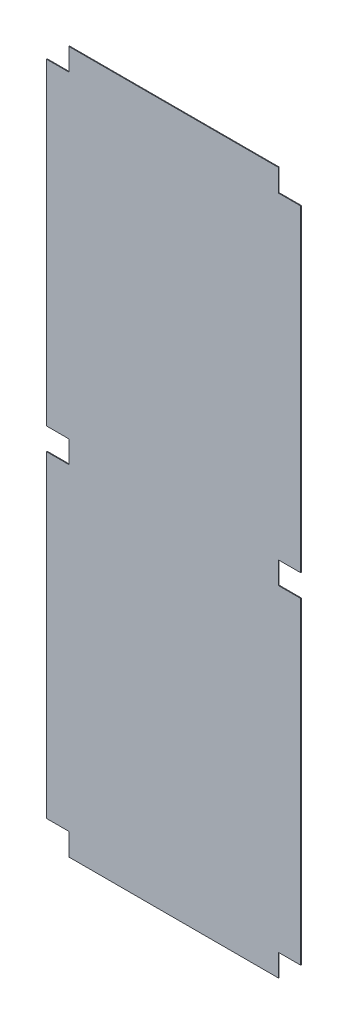
ISO-10303-21;
HEADER;
FILE_DESCRIPTION(('STEP AP214'),'2;1');
FILE_NAME('part.step','',(''),(''),'','','');
FILE_SCHEMA(('AUTOMOTIVE_DESIGN { 1 0 10303 214 1 1 1 1 }'));
ENDSEC;
DATA;
#1=APPLICATION_CONTEXT('core data for automotive mechanical design processes');
#2=APPLICATION_PROTOCOL_DEFINITION('international standard','automotive_design',2000,#1);
#3=PRODUCT_CONTEXT('',#1,'mechanical');
#4=PRODUCT('Part','Part','',(#3));
#5=PRODUCT_RELATED_PRODUCT_CATEGORY('part','',(#4));
#6=PRODUCT_DEFINITION_FORMATION('','',#4);
#7=PRODUCT_DEFINITION_CONTEXT('part definition',#1,'design');
#8=PRODUCT_DEFINITION('design','',#6,#7);
#9=PRODUCT_DEFINITION_SHAPE('','',#8);
#10=(LENGTH_UNIT() NAMED_UNIT(*) SI_UNIT(.MILLI.,.METRE.));
#11=(NAMED_UNIT(*) PLANE_ANGLE_UNIT() SI_UNIT($,.RADIAN.));
#12=(NAMED_UNIT(*) SI_UNIT($,.STERADIAN.) SOLID_ANGLE_UNIT());
#13=UNCERTAINTY_MEASURE_WITH_UNIT(LENGTH_MEASURE(1.E-05),#10,'distance_accuracy_value','');
#14=(GEOMETRIC_REPRESENTATION_CONTEXT(3) GLOBAL_UNCERTAINTY_ASSIGNED_CONTEXT((#13)) GLOBAL_UNIT_ASSIGNED_CONTEXT((#10,
#11,#12)) REPRESENTATION_CONTEXT('',''));
#15=CARTESIAN_POINT('',(0.,0.,0.));
#16=DIRECTION('',(0.,0.,1.));
#17=DIRECTION('',(1.,0.,0.));
#18=AXIS2_PLACEMENT_3D('',#15,#16,#17);
#19=CARTESIAN_POINT('',(0.,0.,-0.7));
#20=DIRECTION('',(-1.,0.,0.));
#21=DIRECTION('',(0.,0.,1.));
#22=AXIS2_PLACEMENT_3D('',#19,#20,#21);
#23=PLANE('',#22);
#24=DIRECTION('',(0.,0.,-1.));
#25=VECTOR('',#24,1.);
#26=CARTESIAN_POINT('',(0.,321.2,9.3));
#27=LINE('',#26,#25);
#28=CARTESIAN_POINT('',(0.,321.2,0.));
#29=VERTEX_POINT('',#28);
#30=CARTESIAN_POINT('',(0.,321.2,-0.7));
#31=VERTEX_POINT('',#30);
#32=EDGE_CURVE('E246',#29,#31,#27,.T.);
#33=ORIENTED_EDGE('',*,*,#32,.T.);
#34=DIRECTION('',(0.,-1.,0.));
#35=VECTOR('',#34,1.);
#36=CARTESIAN_POINT('',(0.,0.,-0.7));
#37=LINE('',#36,#35);
#38=CARTESIAN_POINT('',(0.,20.9999999999998,-0.699999999999999));
#39=VERTEX_POINT('',#38);
#40=EDGE_CURVE('E200',#31,#39,#37,.T.);
#41=ORIENTED_EDGE('',*,*,#40,.T.);
#42=DIRECTION('',(0.,0.,1.));
#43=VECTOR('',#42,1.);
#44=CARTESIAN_POINT('',(0.,20.9999999999998,-10.));
#45=LINE('',#44,#43);
#46=CARTESIAN_POINT('',(0.,20.9999999999998,0.));
#47=VERTEX_POINT('',#46);
#48=EDGE_CURVE('E272',#39,#47,#45,.T.);
#49=ORIENTED_EDGE('',*,*,#48,.T.);
#50=DIRECTION('',(0.,-1.,0.));
#51=VECTOR('',#50,1.);
#52=CARTESIAN_POINT('',(0.,0.,0.));
#53=LINE('',#52,#51);
#54=EDGE_CURVE('E220',#29,#47,#53,.T.);
#55=ORIENTED_EDGE('',*,*,#54,.F.);
#56=EDGE_LOOP('',(#33,#41,#49,#55));
#57=FACE_BOUND('',#56,.T.);
#58=ADVANCED_FACE('F39',(#57),#23,.T.);
#59=CARTESIAN_POINT('',(240.,0.,-0.7));
#60=DIRECTION('',(1.,0.,0.));
#61=DIRECTION('',(0.,0.,-1.));
#62=AXIS2_PLACEMENT_3D('',#59,#60,#61);
#63=PLANE('',#62);
#64=DIRECTION('',(0.,0.,-1.));
#65=VECTOR('',#64,1.);
#66=CARTESIAN_POINT('',(240.,321.2,9.3));
#67=LINE('',#66,#65);
#68=CARTESIAN_POINT('',(240.,321.2,0.));
#69=VERTEX_POINT('',#68);
#70=CARTESIAN_POINT('',(240.,321.2,-0.7));
#71=VERTEX_POINT('',#70);
#72=EDGE_CURVE('E195',#69,#71,#67,.T.);
#73=ORIENTED_EDGE('',*,*,#72,.F.);
#74=DIRECTION('',(0.,1.,0.));
#75=VECTOR('',#74,1.);
#76=CARTESIAN_POINT('',(240.,0.,0.));
#77=LINE('',#76,#75);
#78=CARTESIAN_POINT('',(240.,20.9999999999998,0.));
#79=VERTEX_POINT('',#78);
#80=EDGE_CURVE('E224',#79,#69,#77,.T.);
#81=ORIENTED_EDGE('',*,*,#80,.F.);
#82=DIRECTION('',(0.,0.,1.));
#83=VECTOR('',#82,1.);
#84=CARTESIAN_POINT('',(240.,20.9999999999998,-10.));
#85=LINE('',#84,#83);
#86=CARTESIAN_POINT('',(240.,20.9999999999998,-0.699999999999999));
#87=VERTEX_POINT('',#86);
#88=EDGE_CURVE('E298',#87,#79,#85,.T.);
#89=ORIENTED_EDGE('',*,*,#88,.F.);
#90=DIRECTION('',(0.,1.,0.));
#91=VECTOR('',#90,1.);
#92=CARTESIAN_POINT('',(240.,0.,-0.7));
#93=LINE('',#92,#91);
#94=EDGE_CURVE('E210',#87,#71,#93,.T.);
#95=ORIENTED_EDGE('',*,*,#94,.T.);
#96=EDGE_LOOP('',(#73,#81,#89,#95));
#97=FACE_BOUND('',#96,.T.);
#98=ADVANCED_FACE('F358',(#97),#63,.T.);
#99=DIRECTION('',(0.,0.,-1.));
#100=VECTOR('',#99,1.);
#101=CARTESIAN_POINT('',(0.,342.2,9.3));
#102=LINE('',#101,#100);
#103=CARTESIAN_POINT('',(0.,342.2,0.));
#104=VERTEX_POINT('',#103);
#105=CARTESIAN_POINT('',(0.,342.2,-0.7));
#106=VERTEX_POINT('',#105);
#107=EDGE_CURVE('E174',#104,#106,#102,.T.);
#108=ORIENTED_EDGE('',*,*,#107,.F.);
#109=CARTESIAN_POINT('',(0.,642.4,0.));
#110=VERTEX_POINT('',#109);
#111=EDGE_CURVE('E217',#110,#104,#53,.T.);
#112=ORIENTED_EDGE('',*,*,#111,.F.);
#113=DIRECTION('',(0.,0.,1.));
#114=VECTOR('',#113,1.);
#115=CARTESIAN_POINT('',(2.22044604925031E-13,642.4,-10.));
#116=LINE('',#115,#114);
#117=CARTESIAN_POINT('',(2.22044604925031E-13,642.4,-0.699999999999999));
#118=VERTEX_POINT('',#117);
#119=EDGE_CURVE('E198',#118,#110,#116,.T.);
#120=ORIENTED_EDGE('',*,*,#119,.F.);
#121=EDGE_CURVE('E192',#118,#106,#37,.T.);
#122=ORIENTED_EDGE('',*,*,#121,.T.);
#123=EDGE_LOOP('',(#108,#112,#120,#122));
#124=FACE_BOUND('',#123,.T.);
#125=ADVANCED_FACE('F41',(#124),#23,.T.);
#126=CARTESIAN_POINT('',(0.,663.4,-0.7));
#127=DIRECTION('',(0.,1.,0.));
#128=DIRECTION('',(0.,0.,1.));
#129=AXIS2_PLACEMENT_3D('',#126,#127,#128);
#130=PLANE('',#129);
#131=DIRECTION('',(0.,0.,1.));
#132=VECTOR('',#131,1.);
#133=CARTESIAN_POINT('',(21.,663.4,-10.));
#134=LINE('',#133,#132);
#135=CARTESIAN_POINT('',(21.,663.4,-0.699999999999999));
#136=VERTEX_POINT('',#135);
#137=CARTESIAN_POINT('',(21.,663.4,0.));
#138=VERTEX_POINT('',#137);
#139=EDGE_CURVE('E274',#136,#138,#134,.T.);
#140=ORIENTED_EDGE('',*,*,#139,.T.);
#141=DIRECTION('',(-1.,0.,0.));
#142=VECTOR('',#141,1.);
#143=CARTESIAN_POINT('',(0.,663.4,0.));
#144=LINE('',#143,#142);
#145=CARTESIAN_POINT('',(219.,663.4,0.));
#146=VERTEX_POINT('',#145);
#147=EDGE_CURVE('E205',#146,#138,#144,.T.);
#148=ORIENTED_EDGE('',*,*,#147,.F.);
#149=DIRECTION('',(0.,0.,1.));
#150=VECTOR('',#149,1.);
#151=CARTESIAN_POINT('',(219.,663.4,-10.));
#152=LINE('',#151,#150);
#153=CARTESIAN_POINT('',(219.,663.4,-0.699999999999999));
#154=VERTEX_POINT('',#153);
#155=EDGE_CURVE('E309',#154,#146,#152,.T.);
#156=ORIENTED_EDGE('',*,*,#155,.F.);
#157=DIRECTION('',(-1.,0.,0.));
#158=VECTOR('',#157,1.);
#159=CARTESIAN_POINT('',(0.,663.4,-0.7));
#160=LINE('',#159,#158);
#161=EDGE_CURVE('E213',#154,#136,#160,.T.);
#162=ORIENTED_EDGE('',*,*,#161,.T.);
#163=EDGE_LOOP('',(#140,#148,#156,#162));
#164=FACE_BOUND('',#163,.T.);
#165=ADVANCED_FACE('F387',(#164),#130,.T.);
#166=DIRECTION('',(0.,0.,-1.));
#167=VECTOR('',#166,1.);
#168=CARTESIAN_POINT('',(240.,342.2,9.3));
#169=LINE('',#168,#167);
#170=CARTESIAN_POINT('',(240.,342.2,0.));
#171=VERTEX_POINT('',#170);
#172=CARTESIAN_POINT('',(240.,342.2,-0.7));
#173=VERTEX_POINT('',#172);
#174=EDGE_CURVE('E263',#171,#173,#169,.T.);
#175=ORIENTED_EDGE('',*,*,#174,.T.);
#176=CARTESIAN_POINT('',(240.,642.4,-0.699999999999999));
#177=VERTEX_POINT('',#176);
#178=EDGE_CURVE('E203',#173,#177,#93,.T.);
#179=ORIENTED_EDGE('',*,*,#178,.T.);
#180=DIRECTION('',(0.,0.,1.));
#181=VECTOR('',#180,1.);
#182=CARTESIAN_POINT('',(240.,642.4,-10.));
#183=LINE('',#182,#181);
#184=CARTESIAN_POINT('',(240.,642.4,0.));
#185=VERTEX_POINT('',#184);
#186=EDGE_CURVE('E310',#177,#185,#183,.T.);
#187=ORIENTED_EDGE('',*,*,#186,.T.);
#188=EDGE_CURVE('E223',#171,#185,#77,.T.);
#189=ORIENTED_EDGE('',*,*,#188,.F.);
#190=EDGE_LOOP('',(#175,#179,#187,#189));
#191=FACE_BOUND('',#190,.T.);
#192=ADVANCED_FACE('F373',(#191),#63,.T.);
#193=CARTESIAN_POINT('',(0.,0.,-0.7));
#194=DIRECTION('',(0.,-1.,0.));
#195=DIRECTION('',(0.,0.,-1.));
#196=AXIS2_PLACEMENT_3D('',#193,#194,#195);
#197=PLANE('',#196);
#198=DIRECTION('',(0.,0.,1.));
#199=VECTOR('',#198,1.);
#200=CARTESIAN_POINT('',(219.,-2.22044604925031E-13,-10.));
#201=LINE('',#200,#199);
#202=CARTESIAN_POINT('',(219.,-2.22044604925031E-13,-0.699999999999999));
#203=VERTEX_POINT('',#202);
#204=CARTESIAN_POINT('',(219.,-2.22044604925031E-13,0.));
#205=VERTEX_POINT('',#204);
#206=EDGE_CURVE('E285',#203,#205,#201,.T.);
#207=ORIENTED_EDGE('',*,*,#206,.T.);
#208=DIRECTION('',(1.,0.,0.));
#209=VECTOR('',#208,1.);
#210=CARTESIAN_POINT('',(0.,0.,0.));
#211=LINE('',#210,#209);
#212=CARTESIAN_POINT('',(21.,0.,0.));
#213=VERTEX_POINT('',#212);
#214=EDGE_CURVE('E219',#213,#205,#211,.T.);
#215=ORIENTED_EDGE('',*,*,#214,.F.);
#216=DIRECTION('',(0.,0.,1.));
#217=VECTOR('',#216,1.);
#218=CARTESIAN_POINT('',(21.,-2.22044604925031E-13,-10.));
#219=LINE('',#218,#217);
#220=CARTESIAN_POINT('',(21.,-2.22044604925031E-13,-0.699999999999999));
#221=VERTEX_POINT('',#220);
#222=EDGE_CURVE('E288',#221,#213,#219,.T.);
#223=ORIENTED_EDGE('',*,*,#222,.F.);
#224=DIRECTION('',(1.,0.,0.));
#225=VECTOR('',#224,1.);
#226=CARTESIAN_POINT('',(0.,0.,-0.7));
#227=LINE('',#226,#225);
#228=EDGE_CURVE('E199',#221,#203,#227,.T.);
#229=ORIENTED_EDGE('',*,*,#228,.T.);
#230=EDGE_LOOP('',(#207,#215,#223,#229));
#231=FACE_BOUND('',#230,.T.);
#232=ADVANCED_FACE('F351',(#231),#197,.T.);
#233=CARTESIAN_POINT('',(0.,0.,-0.7));
#234=DIRECTION('',(0.,0.,-1.));
#235=DIRECTION('',(-1.,0.,0.));
#236=AXIS2_PLACEMENT_3D('',#233,#234,#235);
#237=PLANE('',#236);
#238=DIRECTION('',(-1.,0.,0.));
#239=VECTOR('',#238,1.);
#240=CARTESIAN_POINT('',(0.,321.2,-0.7));
#241=LINE('',#240,#239);
#242=CARTESIAN_POINT('',(20.9999999999999,321.2,-0.7));
#243=VERTEX_POINT('',#242);
#244=EDGE_CURVE('E185',#243,#31,#241,.T.);
#245=ORIENTED_EDGE('',*,*,#244,.F.);
#246=DIRECTION('',(0.,-1.,0.));
#247=VECTOR('',#246,1.);
#248=CARTESIAN_POINT('',(20.9999999999999,321.2,-0.7));
#249=LINE('',#248,#247);
#250=CARTESIAN_POINT('',(20.9999999999999,342.2,-0.7));
#251=VERTEX_POINT('',#250);
#252=EDGE_CURVE('E194',#251,#243,#249,.T.);
#253=ORIENTED_EDGE('',*,*,#252,.F.);
#254=DIRECTION('',(1.,0.,0.));
#255=VECTOR('',#254,1.);
#256=CARTESIAN_POINT('',(0.,342.2,-0.7));
#257=LINE('',#256,#255);
#258=EDGE_CURVE('E177',#106,#251,#257,.T.);
#259=ORIENTED_EDGE('',*,*,#258,.F.);
#260=ORIENTED_EDGE('',*,*,#121,.F.);
#261=DIRECTION('',(-1.,0.,0.));
#262=VECTOR('',#261,1.);
#263=CARTESIAN_POINT('',(0.,642.4,-0.7));
#264=LINE('',#263,#262);
#265=CARTESIAN_POINT('',(21.,642.4,-0.699999999999999));
#266=VERTEX_POINT('',#265);
#267=EDGE_CURVE('E320',#266,#118,#264,.T.);
#268=ORIENTED_EDGE('',*,*,#267,.F.);
#269=DIRECTION('',(0.,-1.,0.));
#270=VECTOR('',#269,1.);
#271=CARTESIAN_POINT('',(21.0000000000009,0.,-0.7));
#272=LINE('',#271,#270);
#273=EDGE_CURVE('E322',#136,#266,#272,.T.);
#274=ORIENTED_EDGE('',*,*,#273,.F.);
#275=ORIENTED_EDGE('',*,*,#161,.F.);
#276=DIRECTION('',(0.,1.,0.));
#277=VECTOR('',#276,1.);
#278=CARTESIAN_POINT('',(219.,0.,-0.7));
#279=LINE('',#278,#277);
#280=CARTESIAN_POINT('',(219.,642.4,-0.699999999999999));
#281=VERTEX_POINT('',#280);
#282=EDGE_CURVE('E313',#281,#154,#279,.T.);
#283=ORIENTED_EDGE('',*,*,#282,.F.);
#284=DIRECTION('',(-1.,0.,0.));
#285=VECTOR('',#284,1.);
#286=CARTESIAN_POINT('',(0.,642.4,-0.7));
#287=LINE('',#286,#285);
#288=EDGE_CURVE('E318',#177,#281,#287,.T.);
#289=ORIENTED_EDGE('',*,*,#288,.F.);
#290=ORIENTED_EDGE('',*,*,#178,.F.);
#291=DIRECTION('',(1.,0.,0.));
#292=VECTOR('',#291,1.);
#293=CARTESIAN_POINT('',(240.,342.2,-0.7));
#294=LINE('',#293,#292);
#295=CARTESIAN_POINT('',(219.,342.2,-0.7));
#296=VERTEX_POINT('',#295);
#297=EDGE_CURVE('E259',#296,#173,#294,.T.);
#298=ORIENTED_EDGE('',*,*,#297,.F.);
#299=DIRECTION('',(0.,1.,0.));
#300=VECTOR('',#299,1.);
#301=CARTESIAN_POINT('',(219.,321.2,-0.7));
#302=LINE('',#301,#300);
#303=CARTESIAN_POINT('',(219.,321.2,-0.7));
#304=VERTEX_POINT('',#303);
#305=EDGE_CURVE('E257',#304,#296,#302,.T.);
#306=ORIENTED_EDGE('',*,*,#305,.F.);
#307=DIRECTION('',(-1.,0.,0.));
#308=VECTOR('',#307,1.);
#309=CARTESIAN_POINT('',(240.,321.2,-0.7));
#310=LINE('',#309,#308);
#311=EDGE_CURVE('E254',#71,#304,#310,.T.);
#312=ORIENTED_EDGE('',*,*,#311,.F.);
#313=ORIENTED_EDGE('',*,*,#94,.F.);
#314=DIRECTION('',(1.,0.,0.));
#315=VECTOR('',#314,1.);
#316=CARTESIAN_POINT('',(0.,20.9999999999998,-0.7));
#317=LINE('',#316,#315);
#318=CARTESIAN_POINT('',(219.,20.9999999999998,-0.699999999999999));
#319=VERTEX_POINT('',#318);
#320=EDGE_CURVE('E327',#319,#87,#317,.T.);
#321=ORIENTED_EDGE('',*,*,#320,.F.);
#322=DIRECTION('',(0.,1.,0.));
#323=VECTOR('',#322,1.);
#324=CARTESIAN_POINT('',(219.,0.,-0.7));
#325=LINE('',#324,#323);
#326=EDGE_CURVE('E207',#203,#319,#325,.T.);
#327=ORIENTED_EDGE('',*,*,#326,.F.);
#328=ORIENTED_EDGE('',*,*,#228,.F.);
#329=DIRECTION('',(0.,-1.,0.));
#330=VECTOR('',#329,1.);
#331=CARTESIAN_POINT('',(21.,0.,-0.7));
#332=LINE('',#331,#330);
#333=CARTESIAN_POINT('',(21.,20.9999999999998,-0.699999999999999));
#334=VERTEX_POINT('',#333);
#335=EDGE_CURVE('E324',#334,#221,#332,.T.);
#336=ORIENTED_EDGE('',*,*,#335,.F.);
#337=DIRECTION('',(1.,0.,0.));
#338=VECTOR('',#337,1.);
#339=CARTESIAN_POINT('',(0.,20.9999999999998,-0.7));
#340=LINE('',#339,#338);
#341=EDGE_CURVE('E326',#39,#334,#340,.T.);
#342=ORIENTED_EDGE('',*,*,#341,.F.);
#343=ORIENTED_EDGE('',*,*,#40,.F.);
#344=EDGE_LOOP('',(#245,#253,#259,#260,#268,#274,#275,#283,#289,#290,#298,#306,#312,#313,#321,
#327,#328,#336,#342,#343));
#345=FACE_BOUND('',#344,.T.);
#346=ADVANCED_FACE('F190',(#345),#237,.T.);
#347=CARTESIAN_POINT('',(0.,0.,0.));
#348=DIRECTION('',(0.,0.,-1.));
#349=DIRECTION('',(-1.,0.,0.));
#350=AXIS2_PLACEMENT_3D('',#347,#348,#349);
#351=PLANE('',#350);
#352=DIRECTION('',(0.,-1.,0.));
#353=VECTOR('',#352,1.);
#354=CARTESIAN_POINT('',(20.9999999999998,0.,0.));
#355=LINE('',#354,#353);
#356=CARTESIAN_POINT('',(20.9999999999999,342.2,0.));
#357=VERTEX_POINT('',#356);
#358=CARTESIAN_POINT('',(20.9999999999999,321.2,0.));
#359=VERTEX_POINT('',#358);
#360=EDGE_CURVE('E47',#357,#359,#355,.T.);
#361=ORIENTED_EDGE('',*,*,#360,.T.);
#362=DIRECTION('',(-1.,0.,0.));
#363=VECTOR('',#362,1.);
#364=CARTESIAN_POINT('',(0.,321.2,0.));
#365=LINE('',#364,#363);
#366=EDGE_CURVE('E11',#359,#29,#365,.T.);
#367=ORIENTED_EDGE('',*,*,#366,.T.);
#368=ORIENTED_EDGE('',*,*,#54,.T.);
#369=DIRECTION('',(-1.,0.,0.));
#370=VECTOR('',#369,1.);
#371=CARTESIAN_POINT('',(0.,20.9999999999998,0.));
#372=LINE('',#371,#370);
#373=CARTESIAN_POINT('',(21.,20.9999999999998,0.));
#374=VERTEX_POINT('',#373);
#375=EDGE_CURVE('E284',#374,#47,#372,.T.);
#376=ORIENTED_EDGE('',*,*,#375,.F.);
#377=DIRECTION('',(0.,1.,0.));
#378=VECTOR('',#377,1.);
#379=CARTESIAN_POINT('',(21.,-2.22044604925031E-13,0.));
#380=LINE('',#379,#378);
#381=EDGE_CURVE('E281',#213,#374,#380,.T.);
#382=ORIENTED_EDGE('',*,*,#381,.F.);
#383=ORIENTED_EDGE('',*,*,#214,.T.);
#384=DIRECTION('',(0.,-1.,0.));
#385=VECTOR('',#384,1.);
#386=CARTESIAN_POINT('',(219.,-2.22044604925031E-13,0.));
#387=LINE('',#386,#385);
#388=CARTESIAN_POINT('',(219.,20.9999999999998,0.));
#389=VERTEX_POINT('',#388);
#390=EDGE_CURVE('E296',#389,#205,#387,.T.);
#391=ORIENTED_EDGE('',*,*,#390,.F.);
#392=DIRECTION('',(-1.,0.,0.));
#393=VECTOR('',#392,1.);
#394=CARTESIAN_POINT('',(240.,20.9999999999998,0.));
#395=LINE('',#394,#393);
#396=EDGE_CURVE('E249',#79,#389,#395,.T.);
#397=ORIENTED_EDGE('',*,*,#396,.F.);
#398=ORIENTED_EDGE('',*,*,#80,.T.);
#399=DIRECTION('',(-1.,0.,0.));
#400=VECTOR('',#399,1.);
#401=CARTESIAN_POINT('',(0.,321.2,0.));
#402=LINE('',#401,#400);
#403=CARTESIAN_POINT('',(219.,321.2,0.));
#404=VERTEX_POINT('',#403);
#405=EDGE_CURVE('E234',#69,#404,#402,.T.);
#406=ORIENTED_EDGE('',*,*,#405,.T.);
#407=DIRECTION('',(0.,1.,0.));
#408=VECTOR('',#407,1.);
#409=CARTESIAN_POINT('',(219.,0.,0.));
#410=LINE('',#409,#408);
#411=CARTESIAN_POINT('',(219.,342.2,0.));
#412=VERTEX_POINT('',#411);
#413=EDGE_CURVE('E216',#404,#412,#410,.T.);
#414=ORIENTED_EDGE('',*,*,#413,.T.);
#415=DIRECTION('',(1.,0.,0.));
#416=VECTOR('',#415,1.);
#417=CARTESIAN_POINT('',(9.04567426254117E-13,342.2,0.));
#418=LINE('',#417,#416);
#419=EDGE_CURVE('E231',#412,#171,#418,.T.);
#420=ORIENTED_EDGE('',*,*,#419,.T.);
#421=ORIENTED_EDGE('',*,*,#188,.T.);
#422=DIRECTION('',(1.,0.,0.));
#423=VECTOR('',#422,1.);
#424=CARTESIAN_POINT('',(240.,642.4,0.));
#425=LINE('',#424,#423);
#426=CARTESIAN_POINT('',(219.,642.4,0.));
#427=VERTEX_POINT('',#426);
#428=EDGE_CURVE('E306',#427,#185,#425,.T.);
#429=ORIENTED_EDGE('',*,*,#428,.F.);
#430=DIRECTION('',(0.,-1.,0.));
#431=VECTOR('',#430,1.);
#432=CARTESIAN_POINT('',(219.,663.4,0.));
#433=LINE('',#432,#431);
#434=EDGE_CURVE('E277',#146,#427,#433,.T.);
#435=ORIENTED_EDGE('',*,*,#434,.F.);
#436=ORIENTED_EDGE('',*,*,#147,.T.);
#437=DIRECTION('',(0.,1.,0.));
#438=VECTOR('',#437,1.);
#439=CARTESIAN_POINT('',(21.,663.4,0.));
#440=LINE('',#439,#438);
#441=CARTESIAN_POINT('',(21.,642.4,0.));
#442=VERTEX_POINT('',#441);
#443=EDGE_CURVE('E271',#442,#138,#440,.T.);
#444=ORIENTED_EDGE('',*,*,#443,.F.);
#445=DIRECTION('',(1.,0.,0.));
#446=VECTOR('',#445,1.);
#447=CARTESIAN_POINT('',(2.22044604925031E-13,642.4,0.));
#448=LINE('',#447,#446);
#449=EDGE_CURVE('E268',#110,#442,#448,.T.);
#450=ORIENTED_EDGE('',*,*,#449,.F.);
#451=ORIENTED_EDGE('',*,*,#111,.T.);
#452=DIRECTION('',(1.,0.,0.));
#453=VECTOR('',#452,1.);
#454=CARTESIAN_POINT('',(0.,342.2,0.));
#455=LINE('',#454,#453);
#456=EDGE_CURVE('E180',#104,#357,#455,.T.);
#457=ORIENTED_EDGE('',*,*,#456,.T.);
#458=EDGE_LOOP('',(#361,#367,#368,#376,#382,#383,#391,#397,#398,#406,#414,#420,#421,#429,#435,
#436,#444,#450,#451,#457));
#459=FACE_BOUND('',#458,.T.);
#460=ADVANCED_FACE('F239',(#459),#351,.F.);
#461=CARTESIAN_POINT('',(240.,642.4,-10.));
#462=DIRECTION('',(0.,-1.,0.));
#463=DIRECTION('',(0.,0.,-1.));
#464=AXIS2_PLACEMENT_3D('',#461,#462,#463);
#465=PLANE('',#464);
#466=ORIENTED_EDGE('',*,*,#288,.T.);
#467=DIRECTION('',(0.,0.,1.));
#468=VECTOR('',#467,1.);
#469=CARTESIAN_POINT('',(219.,642.4,-10.));
#470=LINE('',#469,#468);
#471=EDGE_CURVE('E314',#281,#427,#470,.T.);
#472=ORIENTED_EDGE('',*,*,#471,.T.);
#473=ORIENTED_EDGE('',*,*,#428,.T.);
#474=ORIENTED_EDGE('',*,*,#186,.F.);
#475=EDGE_LOOP('',(#466,#472,#473,#474));
#476=FACE_BOUND('',#475,.T.);
#477=ADVANCED_FACE('F378',(#476),#465,.F.);
#478=CARTESIAN_POINT('',(219.,663.4,-10.));
#479=DIRECTION('',(-1.,0.,0.));
#480=DIRECTION('',(0.,0.,1.));
#481=AXIS2_PLACEMENT_3D('',#478,#479,#480);
#482=PLANE('',#481);
#483=ORIENTED_EDGE('',*,*,#282,.T.);
#484=ORIENTED_EDGE('',*,*,#155,.T.);
#485=ORIENTED_EDGE('',*,*,#434,.T.);
#486=ORIENTED_EDGE('',*,*,#471,.F.);
#487=EDGE_LOOP('',(#483,#484,#485,#486));
#488=FACE_BOUND('',#487,.T.);
#489=ADVANCED_FACE('F382',(#488),#482,.F.);
#490=CARTESIAN_POINT('',(21.,663.4,-10.));
#491=DIRECTION('',(1.,0.,0.));
#492=DIRECTION('',(0.,1.,0.));
#493=AXIS2_PLACEMENT_3D('',#490,#491,#492);
#494=PLANE('',#493);
#495=ORIENTED_EDGE('',*,*,#273,.T.);
#496=DIRECTION('',(0.,0.,1.));
#497=VECTOR('',#496,1.);
#498=CARTESIAN_POINT('',(21.,642.4,-10.));
#499=LINE('',#498,#497);
#500=EDGE_CURVE('E278',#266,#442,#499,.T.);
#501=ORIENTED_EDGE('',*,*,#500,.T.);
#502=ORIENTED_EDGE('',*,*,#443,.T.);
#503=ORIENTED_EDGE('',*,*,#139,.F.);
#504=EDGE_LOOP('',(#495,#501,#502,#503));
#505=FACE_BOUND('',#504,.T.);
#506=ADVANCED_FACE('F391',(#505),#494,.F.);
#507=CARTESIAN_POINT('',(2.22044604925031E-13,642.4,-10.));
#508=DIRECTION('',(0.,-1.,0.));
#509=DIRECTION('',(0.,0.,-1.));
#510=AXIS2_PLACEMENT_3D('',#507,#508,#509);
#511=PLANE('',#510);
#512=ORIENTED_EDGE('',*,*,#267,.T.);
#513=ORIENTED_EDGE('',*,*,#119,.T.);
#514=ORIENTED_EDGE('',*,*,#449,.T.);
#515=ORIENTED_EDGE('',*,*,#500,.F.);
#516=EDGE_LOOP('',(#512,#513,#514,#515));
#517=FACE_BOUND('',#516,.T.);
#518=ADVANCED_FACE('F394',(#517),#511,.F.);
#519=CARTESIAN_POINT('',(0.,20.9999999999998,-10.));
#520=DIRECTION('',(0.,1.,0.));
#521=DIRECTION('',(0.,0.,1.));
#522=AXIS2_PLACEMENT_3D('',#519,#520,#521);
#523=PLANE('',#522);
#524=ORIENTED_EDGE('',*,*,#341,.T.);
#525=DIRECTION('',(0.,0.,1.));
#526=VECTOR('',#525,1.);
#527=CARTESIAN_POINT('',(21.,20.9999999999998,-10.));
#528=LINE('',#527,#526);
#529=EDGE_CURVE('E291',#334,#374,#528,.T.);
#530=ORIENTED_EDGE('',*,*,#529,.T.);
#531=ORIENTED_EDGE('',*,*,#375,.T.);
#532=ORIENTED_EDGE('',*,*,#48,.F.);
#533=EDGE_LOOP('',(#524,#530,#531,#532));
#534=FACE_BOUND('',#533,.T.);
#535=ADVANCED_FACE('F339',(#534),#523,.F.);
#536=CARTESIAN_POINT('',(21.,-2.22044604925031E-13,-10.));
#537=DIRECTION('',(1.,0.,0.));
#538=DIRECTION('',(0.,0.,-1.));
#539=AXIS2_PLACEMENT_3D('',#536,#537,#538);
#540=PLANE('',#539);
#541=ORIENTED_EDGE('',*,*,#335,.T.);
#542=ORIENTED_EDGE('',*,*,#222,.T.);
#543=ORIENTED_EDGE('',*,*,#381,.T.);
#544=ORIENTED_EDGE('',*,*,#529,.F.);
#545=EDGE_LOOP('',(#541,#542,#543,#544));
#546=FACE_BOUND('',#545,.T.);
#547=ADVANCED_FACE('F346',(#546),#540,.F.);
#548=CARTESIAN_POINT('',(219.,-2.22044604925031E-13,-10.));
#549=DIRECTION('',(-1.,0.,0.));
#550=DIRECTION('',(0.,0.,1.));
#551=AXIS2_PLACEMENT_3D('',#548,#549,#550);
#552=PLANE('',#551);
#553=ORIENTED_EDGE('',*,*,#326,.T.);
#554=DIRECTION('',(0.,0.,1.));
#555=VECTOR('',#554,1.);
#556=CARTESIAN_POINT('',(219.,20.9999999999998,-10.));
#557=LINE('',#556,#555);
#558=EDGE_CURVE('E301',#319,#389,#557,.T.);
#559=ORIENTED_EDGE('',*,*,#558,.T.);
#560=ORIENTED_EDGE('',*,*,#390,.T.);
#561=ORIENTED_EDGE('',*,*,#206,.F.);
#562=EDGE_LOOP('',(#553,#559,#560,#561));
#563=FACE_BOUND('',#562,.T.);
#564=ADVANCED_FACE('F352',(#563),#552,.F.);
#565=CARTESIAN_POINT('',(240.,20.9999999999998,-10.));
#566=DIRECTION('',(0.,1.,0.));
#567=DIRECTION('',(0.,0.,1.));
#568=AXIS2_PLACEMENT_3D('',#565,#566,#567);
#569=PLANE('',#568);
#570=ORIENTED_EDGE('',*,*,#320,.T.);
#571=ORIENTED_EDGE('',*,*,#88,.T.);
#572=ORIENTED_EDGE('',*,*,#396,.T.);
#573=ORIENTED_EDGE('',*,*,#558,.F.);
#574=EDGE_LOOP('',(#570,#571,#572,#573));
#575=FACE_BOUND('',#574,.T.);
#576=ADVANCED_FACE('F361',(#575),#569,.F.);
#577=CARTESIAN_POINT('',(240.,321.2,9.3));
#578=DIRECTION('',(0.,-1.,0.));
#579=DIRECTION('',(0.,0.,-1.));
#580=AXIS2_PLACEMENT_3D('',#577,#578,#579);
#581=PLANE('',#580);
#582=ORIENTED_EDGE('',*,*,#72,.T.);
#583=ORIENTED_EDGE('',*,*,#311,.T.);
#584=DIRECTION('',(0.,0.,-1.));
#585=VECTOR('',#584,1.);
#586=CARTESIAN_POINT('',(219.,321.2,9.3));
#587=LINE('',#586,#585);
#588=EDGE_CURVE('E261',#404,#304,#587,.T.);
#589=ORIENTED_EDGE('',*,*,#588,.F.);
#590=ORIENTED_EDGE('',*,*,#405,.F.);
#591=EDGE_LOOP('',(#582,#583,#589,#590));
#592=FACE_BOUND('',#591,.T.);
#593=ADVANCED_FACE('F364',(#592),#581,.F.);
#594=CARTESIAN_POINT('',(240.,342.2,9.3));
#595=DIRECTION('',(0.,1.,0.));
#596=DIRECTION('',(-1.,0.,0.));
#597=AXIS2_PLACEMENT_3D('',#594,#595,#596);
#598=PLANE('',#597);
#599=DIRECTION('',(0.,0.,-1.));
#600=VECTOR('',#599,1.);
#601=CARTESIAN_POINT('',(219.,342.2,9.3));
#602=LINE('',#601,#600);
#603=EDGE_CURVE('E62',#412,#296,#602,.T.);
#604=ORIENTED_EDGE('',*,*,#603,.T.);
#605=ORIENTED_EDGE('',*,*,#297,.T.);
#606=ORIENTED_EDGE('',*,*,#174,.F.);
#607=ORIENTED_EDGE('',*,*,#419,.F.);
#608=EDGE_LOOP('',(#604,#605,#606,#607));
#609=FACE_BOUND('',#608,.T.);
#610=ADVANCED_FACE('F370',(#609),#598,.F.);
#611=CARTESIAN_POINT('',(219.,321.2,9.3));
#612=DIRECTION('',(-1.,0.,0.));
#613=DIRECTION('',(0.,0.,1.));
#614=AXIS2_PLACEMENT_3D('',#611,#612,#613);
#615=PLANE('',#614);
#616=ORIENTED_EDGE('',*,*,#588,.T.);
#617=ORIENTED_EDGE('',*,*,#305,.T.);
#618=ORIENTED_EDGE('',*,*,#603,.F.);
#619=ORIENTED_EDGE('',*,*,#413,.F.);
#620=EDGE_LOOP('',(#616,#617,#618,#619));
#621=FACE_BOUND('',#620,.T.);
#622=ADVANCED_FACE('F365',(#621),#615,.F.);
#623=CARTESIAN_POINT('',(0.,321.2,9.3));
#624=DIRECTION('',(0.,-1.,0.));
#625=DIRECTION('',(0.,0.,-1.));
#626=AXIS2_PLACEMENT_3D('',#623,#624,#625);
#627=PLANE('',#626);
#628=DIRECTION('',(0.,0.,-1.));
#629=VECTOR('',#628,1.);
#630=CARTESIAN_POINT('',(20.9999999999999,321.2,9.3));
#631=LINE('',#630,#629);
#632=EDGE_CURVE('E244',#359,#243,#631,.T.);
#633=ORIENTED_EDGE('',*,*,#632,.T.);
#634=ORIENTED_EDGE('',*,*,#244,.T.);
#635=ORIENTED_EDGE('',*,*,#32,.F.);
#636=ORIENTED_EDGE('',*,*,#366,.F.);
#637=EDGE_LOOP('',(#633,#634,#635,#636));
#638=FACE_BOUND('',#637,.T.);
#639=ADVANCED_FACE('F467',(#638),#627,.F.);
#640=CARTESIAN_POINT('',(20.9999999999999,321.2,9.3));
#641=DIRECTION('',(1.,0.,0.));
#642=DIRECTION('',(0.,1.,0.));
#643=AXIS2_PLACEMENT_3D('',#640,#641,#642);
#644=PLANE('',#643);
#645=DIRECTION('',(0.,0.,-1.));
#646=VECTOR('',#645,1.);
#647=CARTESIAN_POINT('',(20.9999999999999,342.2,9.3));
#648=LINE('',#647,#646);
#649=EDGE_CURVE('E54',#357,#251,#648,.T.);
#650=ORIENTED_EDGE('',*,*,#649,.T.);
#651=ORIENTED_EDGE('',*,*,#252,.T.);
#652=ORIENTED_EDGE('',*,*,#632,.F.);
#653=ORIENTED_EDGE('',*,*,#360,.F.);
#654=EDGE_LOOP('',(#650,#651,#652,#653));
#655=FACE_BOUND('',#654,.T.);
#656=ADVANCED_FACE('F243',(#655),#644,.F.);
#657=CARTESIAN_POINT('',(0.,342.2,9.3));
#658=DIRECTION('',(0.,1.,0.));
#659=DIRECTION('',(0.,0.,1.));
#660=AXIS2_PLACEMENT_3D('',#657,#658,#659);
#661=PLANE('',#660);
#662=ORIENTED_EDGE('',*,*,#107,.T.);
#663=ORIENTED_EDGE('',*,*,#258,.T.);
#664=ORIENTED_EDGE('',*,*,#649,.F.);
#665=ORIENTED_EDGE('',*,*,#456,.F.);
#666=EDGE_LOOP('',(#662,#663,#664,#665));
#667=FACE_BOUND('',#666,.T.);
#668=ADVANCED_FACE('F176',(#667),#661,.F.);
#669=CLOSED_SHELL('',(#58,#98,#125,#165,#192,#232,#346,#460,#477,#489,#506,#518,#535,#547,#564,
#576,#593,#610,#622,#639,#656,#668));
#670=MANIFOLD_SOLID_BREP('B2',#669);
#671=ADVANCED_BREP_SHAPE_REPRESENTATION('',(#18,#670),#14);
#672=SHAPE_DEFINITION_REPRESENTATION(#9,#671);
ENDSEC;
END-ISO-10303-21;
